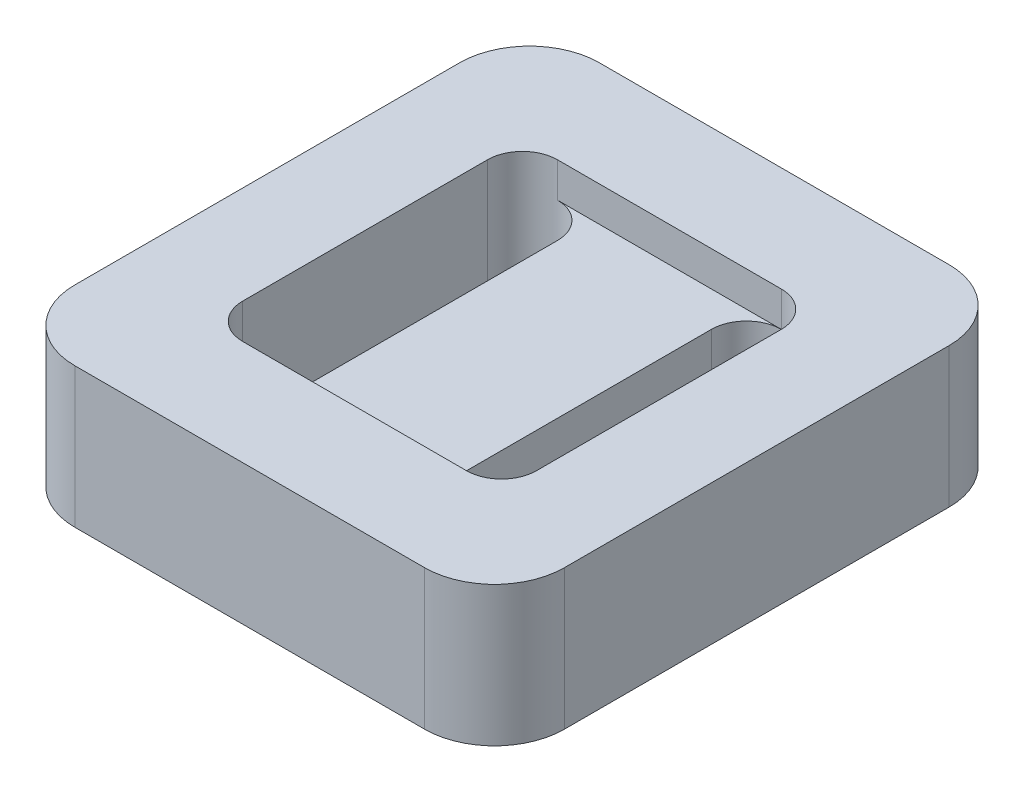
ISO-10303-21;
HEADER;
FILE_DESCRIPTION(('STEP AP214'),'2;1');
FILE_NAME('part.step','',(''),(''),'','','');
FILE_SCHEMA(('AUTOMOTIVE_DESIGN { 1 0 10303 214 1 1 1 1 }'));
ENDSEC;
DATA;
#1=APPLICATION_CONTEXT('core data for automotive mechanical design processes');
#2=APPLICATION_PROTOCOL_DEFINITION('international standard','automotive_design',2000,#1);
#3=PRODUCT_CONTEXT('',#1,'mechanical');
#4=PRODUCT('Part','Part','',(#3));
#5=PRODUCT_RELATED_PRODUCT_CATEGORY('part','',(#4));
#6=PRODUCT_DEFINITION_FORMATION('','',#4);
#7=PRODUCT_DEFINITION_CONTEXT('part definition',#1,'design');
#8=PRODUCT_DEFINITION('design','',#6,#7);
#9=PRODUCT_DEFINITION_SHAPE('','',#8);
#10=(LENGTH_UNIT() NAMED_UNIT(*) SI_UNIT(.MILLI.,.METRE.));
#11=(NAMED_UNIT(*) PLANE_ANGLE_UNIT() SI_UNIT($,.RADIAN.));
#12=(NAMED_UNIT(*) SI_UNIT($,.STERADIAN.) SOLID_ANGLE_UNIT());
#13=UNCERTAINTY_MEASURE_WITH_UNIT(LENGTH_MEASURE(1.E-05),#10,'distance_accuracy_value','');
#14=(GEOMETRIC_REPRESENTATION_CONTEXT(3) GLOBAL_UNCERTAINTY_ASSIGNED_CONTEXT((#13)) GLOBAL_UNIT_ASSIGNED_CONTEXT((#10,
#11,#12)) REPRESENTATION_CONTEXT('',''));
#15=CARTESIAN_POINT('',(0.,0.,0.));
#16=DIRECTION('',(0.,0.,1.));
#17=DIRECTION('',(1.,0.,0.));
#18=AXIS2_PLACEMENT_3D('',#15,#16,#17);
#19=CARTESIAN_POINT('',(-25.,20.,27.5));
#20=DIRECTION('',(0.,-1.,0.));
#21=DIRECTION('',(0.,0.,-1.));
#22=AXIS2_PLACEMENT_3D('',#19,#20,#21);
#23=PLANE('',#22);
#24=CARTESIAN_POINT('',(-25.,20.,27.5));
#25=DIRECTION('',(0.,1.,0.));
#26=DIRECTION('',(0.,0.,-1.));
#27=AXIS2_PLACEMENT_3D('',#24,#25,#26);
#28=CIRCLE('',#27,10.);
#29=CARTESIAN_POINT('',(-35.,20.,27.4999999999999));
#30=VERTEX_POINT('',#29);
#31=CARTESIAN_POINT('',(-24.9999999999999,20.,37.5));
#32=VERTEX_POINT('',#31);
#33=EDGE_CURVE('E258',#30,#32,#28,.T.);
#34=ORIENTED_EDGE('',*,*,#33,.T.);
#35=DIRECTION('',(1.,0.,0.));
#36=VECTOR('',#35,1.);
#37=CARTESIAN_POINT('',(-24.9999999999999,20.,37.5));
#38=LINE('',#37,#36);
#39=CARTESIAN_POINT('',(24.9999999999999,20.,37.5));
#40=VERTEX_POINT('',#39);
#41=EDGE_CURVE('E261',#32,#40,#38,.T.);
#42=ORIENTED_EDGE('',*,*,#41,.T.);
#43=CARTESIAN_POINT('',(25.,20.,27.5));
#44=DIRECTION('',(0.,1.,0.));
#45=DIRECTION('',(0.,0.,1.));
#46=AXIS2_PLACEMENT_3D('',#43,#44,#45);
#47=CIRCLE('',#46,10.);
#48=CARTESIAN_POINT('',(35.,20.,27.4999999999999));
#49=VERTEX_POINT('',#48);
#50=EDGE_CURVE('E264',#40,#49,#47,.T.);
#51=ORIENTED_EDGE('',*,*,#50,.T.);
#52=DIRECTION('',(0.,0.,-1.));
#53=VECTOR('',#52,1.);
#54=CARTESIAN_POINT('',(35.,20.,27.4999999999999));
#55=LINE('',#54,#53);
#56=CARTESIAN_POINT('',(35.,20.,-27.4999999999999));
#57=VERTEX_POINT('',#56);
#58=EDGE_CURVE('E266',#49,#57,#55,.T.);
#59=ORIENTED_EDGE('',*,*,#58,.T.);
#60=CARTESIAN_POINT('',(25.,20.,-27.5));
#61=DIRECTION('',(0.,1.,0.));
#62=DIRECTION('',(0.,0.,1.));
#63=AXIS2_PLACEMENT_3D('',#60,#61,#62);
#64=CIRCLE('',#63,10.);
#65=CARTESIAN_POINT('',(24.9999999999999,20.,-37.5));
#66=VERTEX_POINT('',#65);
#67=EDGE_CURVE('E268',#57,#66,#64,.T.);
#68=ORIENTED_EDGE('',*,*,#67,.T.);
#69=DIRECTION('',(-1.,0.,0.));
#70=VECTOR('',#69,1.);
#71=CARTESIAN_POINT('',(-24.9999999999999,20.,-37.5));
#72=LINE('',#71,#70);
#73=CARTESIAN_POINT('',(-24.9999999999999,20.,-37.5));
#74=VERTEX_POINT('',#73);
#75=EDGE_CURVE('E270',#66,#74,#72,.T.);
#76=ORIENTED_EDGE('',*,*,#75,.T.);
#77=CARTESIAN_POINT('',(-25.,20.,-27.5));
#78=DIRECTION('',(0.,1.,0.));
#79=DIRECTION('',(0.,0.,-1.));
#80=AXIS2_PLACEMENT_3D('',#77,#78,#79);
#81=CIRCLE('',#80,10.);
#82=CARTESIAN_POINT('',(-35.,20.,-27.4999999999999));
#83=VERTEX_POINT('',#82);
#84=EDGE_CURVE('E272',#74,#83,#81,.T.);
#85=ORIENTED_EDGE('',*,*,#84,.T.);
#86=DIRECTION('',(0.,0.,1.));
#87=VECTOR('',#86,1.);
#88=CARTESIAN_POINT('',(-35.,20.,27.4999999999999));
#89=LINE('',#88,#87);
#90=EDGE_CURVE('E274',#83,#30,#89,.T.);
#91=ORIENTED_EDGE('',*,*,#90,.T.);
#92=EDGE_LOOP('',(#34,#42,#51,#59,#68,#76,#85,#91));
#93=FACE_BOUND('',#92,.T.);
#94=DIRECTION('',(1.,0.,0.));
#95=VECTOR('',#94,1.);
#96=CARTESIAN_POINT('',(0.,20.,-22.5000000000001));
#97=LINE('',#96,#95);
#98=CARTESIAN_POINT('',(-16.,20.,-22.5));
#99=VERTEX_POINT('',#98);
#100=CARTESIAN_POINT('',(15.9999999999999,20.,-22.5000000000001));
#101=VERTEX_POINT('',#100);
#102=EDGE_CURVE('E189',#99,#101,#97,.T.);
#103=ORIENTED_EDGE('',*,*,#102,.T.);
#104=CARTESIAN_POINT('',(15.9999999999999,20.,-17.5000000000001));
#105=DIRECTION('',(0.,1.,0.));
#106=DIRECTION('',(0.,0.,-1.));
#107=AXIS2_PLACEMENT_3D('',#104,#105,#106);
#108=CIRCLE('',#107,5.);
#109=CARTESIAN_POINT('',(20.9999999999999,20.,-17.5000000000002));
#110=VERTEX_POINT('',#109);
#111=EDGE_CURVE('E208',#110,#101,#108,.T.);
#112=ORIENTED_EDGE('',*,*,#111,.F.);
#113=DIRECTION('',(0.,0.,-1.));
#114=VECTOR('',#113,1.);
#115=CARTESIAN_POINT('',(21.0000000000001,20.,17.4999999999999));
#116=LINE('',#115,#114);
#117=CARTESIAN_POINT('',(21.0000000000001,20.,17.4999999999999));
#118=VERTEX_POINT('',#117);
#119=EDGE_CURVE('E205',#118,#110,#116,.T.);
#120=ORIENTED_EDGE('',*,*,#119,.F.);
#121=CARTESIAN_POINT('',(16.0000000000001,20.,17.4999999999999));
#122=DIRECTION('',(0.,1.,0.));
#123=DIRECTION('',(0.,0.,-1.));
#124=AXIS2_PLACEMENT_3D('',#121,#122,#123);
#125=CIRCLE('',#124,5.);
#126=CARTESIAN_POINT('',(16.0000000000002,20.,22.4999999999999));
#127=VERTEX_POINT('',#126);
#128=EDGE_CURVE('E203',#127,#118,#125,.T.);
#129=ORIENTED_EDGE('',*,*,#128,.F.);
#130=DIRECTION('',(1.,0.,0.));
#131=VECTOR('',#130,1.);
#132=CARTESIAN_POINT('',(0.,20.,22.5));
#133=LINE('',#132,#131);
#134=CARTESIAN_POINT('',(-16.,20.,22.5));
#135=VERTEX_POINT('',#134);
#136=EDGE_CURVE('E406',#135,#127,#133,.T.);
#137=ORIENTED_EDGE('',*,*,#136,.F.);
#138=CARTESIAN_POINT('',(-16.,20.,17.5));
#139=DIRECTION('',(0.,1.,0.));
#140=DIRECTION('',(0.,0.,1.));
#141=AXIS2_PLACEMENT_3D('',#138,#139,#140);
#142=CIRCLE('',#141,5.);
#143=CARTESIAN_POINT('',(-21.,20.,17.5));
#144=VERTEX_POINT('',#143);
#145=EDGE_CURVE('E195',#144,#135,#142,.T.);
#146=ORIENTED_EDGE('',*,*,#145,.F.);
#147=DIRECTION('',(0.,0.,1.));
#148=VECTOR('',#147,1.);
#149=CARTESIAN_POINT('',(-21.,20.,17.5));
#150=LINE('',#149,#148);
#151=CARTESIAN_POINT('',(-21.,20.,-17.5));
#152=VERTEX_POINT('',#151);
#153=EDGE_CURVE('E236',#152,#144,#150,.T.);
#154=ORIENTED_EDGE('',*,*,#153,.F.);
#155=CARTESIAN_POINT('',(-16.,20.,-17.5));
#156=DIRECTION('',(0.,1.,0.));
#157=DIRECTION('',(0.,0.,1.));
#158=AXIS2_PLACEMENT_3D('',#155,#156,#157);
#159=CIRCLE('',#158,5.);
#160=EDGE_CURVE('E233',#99,#152,#159,.T.);
#161=ORIENTED_EDGE('',*,*,#160,.F.);
#162=EDGE_LOOP('',(#103,#112,#120,#129,#137,#146,#154,#161));
#163=FACE_BOUND('',#162,.T.);
#164=ADVANCED_FACE('F36',(#93,#163),#23,.F.);
#165=CARTESIAN_POINT('',(-16.,20.,17.5));
#166=DIRECTION('',(0.,-1.,0.));
#167=DIRECTION('',(0.,0.,-1.));
#168=AXIS2_PLACEMENT_3D('',#165,#166,#167);
#169=CYLINDRICAL_SURFACE('',#168,5.);
#170=ORIENTED_EDGE('',*,*,#145,.T.);
#171=DIRECTION('',(0.,1.,0.));
#172=VECTOR('',#171,1.);
#173=CARTESIAN_POINT('',(-16.,15.,22.5));
#174=LINE('',#173,#172);
#175=CARTESIAN_POINT('',(-16.,15.,22.5));
#176=VERTEX_POINT('',#175);
#177=EDGE_CURVE('E177',#176,#135,#174,.T.);
#178=ORIENTED_EDGE('',*,*,#177,.F.);
#179=CARTESIAN_POINT('',(-16.,15.,17.5));
#180=DIRECTION('',(0.,1.,0.));
#181=DIRECTION('',(0.,0.,1.));
#182=AXIS2_PLACEMENT_3D('',#179,#180,#181);
#183=CIRCLE('',#182,5.);
#184=CARTESIAN_POINT('',(-11.,15.,17.5));
#185=VERTEX_POINT('',#184);
#186=EDGE_CURVE('E181',#185,#176,#183,.F.);
#187=ORIENTED_EDGE('',*,*,#186,.F.);
#188=DIRECTION('',(0.,-1.,0.));
#189=VECTOR('',#188,1.);
#190=CARTESIAN_POINT('',(-11.,20.,17.5));
#191=LINE('',#190,#189);
#192=CARTESIAN_POINT('',(-11.,0.,17.5));
#193=VERTEX_POINT('',#192);
#194=EDGE_CURVE('E255',#185,#193,#191,.T.);
#195=ORIENTED_EDGE('',*,*,#194,.T.);
#196=CARTESIAN_POINT('',(-16.,0.,17.5));
#197=DIRECTION('',(0.,1.,0.));
#198=DIRECTION('',(0.,0.,1.));
#199=AXIS2_PLACEMENT_3D('',#196,#197,#198);
#200=CIRCLE('',#199,5.);
#201=CARTESIAN_POINT('',(-21.,0.,17.5));
#202=VERTEX_POINT('',#201);
#203=EDGE_CURVE('E231',#202,#193,#200,.T.);
#204=ORIENTED_EDGE('',*,*,#203,.F.);
#205=DIRECTION('',(0.,-1.,0.));
#206=VECTOR('',#205,1.);
#207=CARTESIAN_POINT('',(-21.,20.,17.5));
#208=LINE('',#207,#206);
#209=EDGE_CURVE('E238',#144,#202,#208,.T.);
#210=ORIENTED_EDGE('',*,*,#209,.F.);
#211=EDGE_LOOP('',(#170,#178,#187,#195,#204,#210));
#212=FACE_BOUND('',#211,.T.);
#213=ADVANCED_FACE('F192',(#212),#169,.F.);
#214=CARTESIAN_POINT('',(-11.,20.,17.5));
#215=DIRECTION('',(-1.,0.,0.));
#216=DIRECTION('',(0.,0.,1.));
#217=AXIS2_PLACEMENT_3D('',#214,#215,#216);
#218=PLANE('',#217);
#219=ORIENTED_EDGE('',*,*,#194,.F.);
#220=DIRECTION('',(0.,0.,1.));
#221=VECTOR('',#220,1.);
#222=CARTESIAN_POINT('',(-11.,15.,0.));
#223=LINE('',#222,#221);
#224=CARTESIAN_POINT('',(-11.,15.,-17.5));
#225=VERTEX_POINT('',#224);
#226=EDGE_CURVE('E186',#225,#185,#223,.T.);
#227=ORIENTED_EDGE('',*,*,#226,.F.);
#228=DIRECTION('',(0.,-1.,0.));
#229=VECTOR('',#228,1.);
#230=CARTESIAN_POINT('',(-11.,20.,-17.5));
#231=LINE('',#230,#229);
#232=CARTESIAN_POINT('',(-11.,0.,-17.5));
#233=VERTEX_POINT('',#232);
#234=EDGE_CURVE('E253',#225,#233,#231,.T.);
#235=ORIENTED_EDGE('',*,*,#234,.T.);
#236=DIRECTION('',(0.,0.,-1.));
#237=VECTOR('',#236,1.);
#238=CARTESIAN_POINT('',(-11.,0.,17.5));
#239=LINE('',#238,#237);
#240=EDGE_CURVE('E241',#193,#233,#239,.T.);
#241=ORIENTED_EDGE('',*,*,#240,.F.);
#242=EDGE_LOOP('',(#219,#227,#235,#241));
#243=FACE_BOUND('',#242,.T.);
#244=ADVANCED_FACE('F364',(#243),#218,.T.);
#245=CARTESIAN_POINT('',(15.9999999999999,20.,-17.5000000000001));
#246=DIRECTION('',(0.,-1.,0.));
#247=DIRECTION('',(0.,0.,-1.));
#248=AXIS2_PLACEMENT_3D('',#245,#246,#247);
#249=CYLINDRICAL_SURFACE('',#248,5.);
#250=ORIENTED_EDGE('',*,*,#111,.T.);
#251=DIRECTION('',(0.,1.,0.));
#252=VECTOR('',#251,1.);
#253=CARTESIAN_POINT('',(15.9999999999999,15.,-22.5000000000001));
#254=LINE('',#253,#252);
#255=CARTESIAN_POINT('',(15.9999999999999,15.,-22.5000000000001));
#256=VERTEX_POINT('',#255);
#257=EDGE_CURVE('E197',#256,#101,#254,.T.);
#258=ORIENTED_EDGE('',*,*,#257,.F.);
#259=CARTESIAN_POINT('',(15.9999999999999,15.,-17.5000000000001));
#260=DIRECTION('',(0.,1.,0.));
#261=DIRECTION('',(0.,0.,1.));
#262=AXIS2_PLACEMENT_3D('',#259,#260,#261);
#263=CIRCLE('',#262,5.);
#264=CARTESIAN_POINT('',(10.9999999999999,15.,-17.5000000000001));
#265=VERTEX_POINT('',#264);
#266=EDGE_CURVE('E428',#265,#256,#263,.F.);
#267=ORIENTED_EDGE('',*,*,#266,.F.);
#268=DIRECTION('',(0.,-1.,0.));
#269=VECTOR('',#268,1.);
#270=CARTESIAN_POINT('',(10.9999999999999,20.,-17.5000000000001));
#271=LINE('',#270,#269);
#272=CARTESIAN_POINT('',(10.9999999999999,0.,-17.5000000000001));
#273=VERTEX_POINT('',#272);
#274=EDGE_CURVE('E224',#265,#273,#271,.T.);
#275=ORIENTED_EDGE('',*,*,#274,.T.);
#276=CARTESIAN_POINT('',(15.9999999999999,0.,-17.5000000000001));
#277=DIRECTION('',(0.,1.,0.));
#278=DIRECTION('',(0.,0.,-1.));
#279=AXIS2_PLACEMENT_3D('',#276,#277,#278);
#280=CIRCLE('',#279,5.);
#281=CARTESIAN_POINT('',(20.9999999999999,0.,-17.5000000000002));
#282=VERTEX_POINT('',#281);
#283=EDGE_CURVE('E218',#282,#273,#280,.T.);
#284=ORIENTED_EDGE('',*,*,#283,.F.);
#285=DIRECTION('',(0.,-1.,0.));
#286=VECTOR('',#285,1.);
#287=CARTESIAN_POINT('',(20.9999999999999,20.,-17.5000000000002));
#288=LINE('',#287,#286);
#289=EDGE_CURVE('E226',#110,#282,#288,.T.);
#290=ORIENTED_EDGE('',*,*,#289,.F.);
#291=EDGE_LOOP('',(#250,#258,#267,#275,#284,#290));
#292=FACE_BOUND('',#291,.T.);
#293=ADVANCED_FACE('F388',(#292),#249,.F.);
#294=CARTESIAN_POINT('',(11.0000000000001,20.,17.4999999999999));
#295=DIRECTION('',(1.,0.,0.));
#296=DIRECTION('',(0.,0.,-1.));
#297=AXIS2_PLACEMENT_3D('',#294,#295,#296);
#298=PLANE('',#297);
#299=ORIENTED_EDGE('',*,*,#274,.F.);
#300=DIRECTION('',(0.,0.,-1.));
#301=VECTOR('',#300,1.);
#302=CARTESIAN_POINT('',(11.,15.,0.));
#303=LINE('',#302,#301);
#304=CARTESIAN_POINT('',(11.0000000000001,15.,17.4999999999999));
#305=VERTEX_POINT('',#304);
#306=EDGE_CURVE('E427',#305,#265,#303,.T.);
#307=ORIENTED_EDGE('',*,*,#306,.F.);
#308=DIRECTION('',(0.,-1.,0.));
#309=VECTOR('',#308,1.);
#310=CARTESIAN_POINT('',(11.0000000000001,20.,17.4999999999999));
#311=LINE('',#310,#309);
#312=CARTESIAN_POINT('',(11.0000000000001,0.,17.4999999999999));
#313=VERTEX_POINT('',#312);
#314=EDGE_CURVE('E58',#305,#313,#311,.T.);
#315=ORIENTED_EDGE('',*,*,#314,.T.);
#316=DIRECTION('',(0.,0.,1.));
#317=VECTOR('',#316,1.);
#318=CARTESIAN_POINT('',(11.0000000000001,0.,17.4999999999999));
#319=LINE('',#318,#317);
#320=EDGE_CURVE('E206',#273,#313,#319,.T.);
#321=ORIENTED_EDGE('',*,*,#320,.F.);
#322=EDGE_LOOP('',(#299,#307,#315,#321));
#323=FACE_BOUND('',#322,.T.);
#324=ADVANCED_FACE('F370',(#323),#298,.T.);
#325=CARTESIAN_POINT('',(-25.,0.,27.5));
#326=DIRECTION('',(0.,-1.,0.));
#327=DIRECTION('',(0.,0.,-1.));
#328=AXIS2_PLACEMENT_3D('',#325,#326,#327);
#329=PLANE('',#328);
#330=CARTESIAN_POINT('',(-25.,0.,27.5));
#331=DIRECTION('',(0.,1.,0.));
#332=DIRECTION('',(0.,0.,-1.));
#333=AXIS2_PLACEMENT_3D('',#330,#331,#332);
#334=CIRCLE('',#333,10.);
#335=CARTESIAN_POINT('',(-35.,0.,27.4999999999999));
#336=VERTEX_POINT('',#335);
#337=CARTESIAN_POINT('',(-24.9999999999999,0.,37.5));
#338=VERTEX_POINT('',#337);
#339=EDGE_CURVE('E257',#336,#338,#334,.T.);
#340=ORIENTED_EDGE('',*,*,#339,.F.);
#341=DIRECTION('',(0.,0.,1.));
#342=VECTOR('',#341,1.);
#343=CARTESIAN_POINT('',(-35.,0.,27.4999999999999));
#344=LINE('',#343,#342);
#345=CARTESIAN_POINT('',(-35.,0.,-27.4999999999999));
#346=VERTEX_POINT('',#345);
#347=EDGE_CURVE('E262',#346,#336,#344,.T.);
#348=ORIENTED_EDGE('',*,*,#347,.F.);
#349=CARTESIAN_POINT('',(-25.,0.,-27.5));
#350=DIRECTION('',(0.,1.,0.));
#351=DIRECTION('',(0.,0.,-1.));
#352=AXIS2_PLACEMENT_3D('',#349,#350,#351);
#353=CIRCLE('',#352,10.);
#354=CARTESIAN_POINT('',(-24.9999999999999,0.,-37.5));
#355=VERTEX_POINT('',#354);
#356=EDGE_CURVE('E289',#355,#346,#353,.T.);
#357=ORIENTED_EDGE('',*,*,#356,.F.);
#358=DIRECTION('',(-1.,0.,0.));
#359=VECTOR('',#358,1.);
#360=CARTESIAN_POINT('',(-24.9999999999999,0.,-37.5));
#361=LINE('',#360,#359);
#362=CARTESIAN_POINT('',(24.9999999999999,0.,-37.5));
#363=VERTEX_POINT('',#362);
#364=EDGE_CURVE('E287',#363,#355,#361,.T.);
#365=ORIENTED_EDGE('',*,*,#364,.F.);
#366=CARTESIAN_POINT('',(25.,0.,-27.5));
#367=DIRECTION('',(0.,1.,0.));
#368=DIRECTION('',(0.,0.,1.));
#369=AXIS2_PLACEMENT_3D('',#366,#367,#368);
#370=CIRCLE('',#369,10.);
#371=CARTESIAN_POINT('',(35.,0.,-27.4999999999999));
#372=VERTEX_POINT('',#371);
#373=EDGE_CURVE('E285',#372,#363,#370,.T.);
#374=ORIENTED_EDGE('',*,*,#373,.F.);
#375=DIRECTION('',(0.,0.,-1.));
#376=VECTOR('',#375,1.);
#377=CARTESIAN_POINT('',(35.,0.,27.4999999999999));
#378=LINE('',#377,#376);
#379=CARTESIAN_POINT('',(35.,0.,27.4999999999999));
#380=VERTEX_POINT('',#379);
#381=EDGE_CURVE('E283',#380,#372,#378,.T.);
#382=ORIENTED_EDGE('',*,*,#381,.F.);
#383=CARTESIAN_POINT('',(25.,0.,27.5));
#384=DIRECTION('',(0.,1.,0.));
#385=DIRECTION('',(0.,0.,1.));
#386=AXIS2_PLACEMENT_3D('',#383,#384,#385);
#387=CIRCLE('',#386,10.);
#388=CARTESIAN_POINT('',(24.9999999999999,0.,37.5));
#389=VERTEX_POINT('',#388);
#390=EDGE_CURVE('E281',#389,#380,#387,.T.);
#391=ORIENTED_EDGE('',*,*,#390,.F.);
#392=DIRECTION('',(1.,0.,0.));
#393=VECTOR('',#392,1.);
#394=CARTESIAN_POINT('',(-24.9999999999999,0.,37.5));
#395=LINE('',#394,#393);
#396=EDGE_CURVE('E279',#338,#389,#395,.T.);
#397=ORIENTED_EDGE('',*,*,#396,.F.);
#398=EDGE_LOOP('',(#340,#348,#357,#365,#374,#382,#391,#397));
#399=FACE_BOUND('',#398,.T.);
#400=DIRECTION('',(0.,0.,1.));
#401=VECTOR('',#400,1.);
#402=CARTESIAN_POINT('',(-21.,0.,17.5));
#403=LINE('',#402,#401);
#404=CARTESIAN_POINT('',(-21.,0.,-17.5));
#405=VERTEX_POINT('',#404);
#406=EDGE_CURVE('E234',#405,#202,#403,.T.);
#407=ORIENTED_EDGE('',*,*,#406,.T.);
#408=ORIENTED_EDGE('',*,*,#203,.T.);
#409=ORIENTED_EDGE('',*,*,#240,.T.);
#410=CARTESIAN_POINT('',(-16.,0.,-17.5));
#411=DIRECTION('',(0.,1.,0.));
#412=DIRECTION('',(0.,0.,1.));
#413=AXIS2_PLACEMENT_3D('',#410,#411,#412);
#414=CIRCLE('',#413,5.);
#415=EDGE_CURVE('E244',#233,#405,#414,.T.);
#416=ORIENTED_EDGE('',*,*,#415,.T.);
#417=EDGE_LOOP('',(#407,#408,#409,#416));
#418=FACE_BOUND('',#417,.T.);
#419=ORIENTED_EDGE('',*,*,#320,.T.);
#420=CARTESIAN_POINT('',(16.0000000000001,0.,17.4999999999999));
#421=DIRECTION('',(0.,1.,0.));
#422=DIRECTION('',(0.,0.,-1.));
#423=AXIS2_PLACEMENT_3D('',#420,#421,#422);
#424=CIRCLE('',#423,5.);
#425=CARTESIAN_POINT('',(21.0000000000001,0.,17.4999999999999));
#426=VERTEX_POINT('',#425);
#427=EDGE_CURVE('E211',#313,#426,#424,.T.);
#428=ORIENTED_EDGE('',*,*,#427,.T.);
#429=DIRECTION('',(0.,0.,-1.));
#430=VECTOR('',#429,1.);
#431=CARTESIAN_POINT('',(21.0000000000001,0.,17.4999999999999));
#432=LINE('',#431,#430);
#433=EDGE_CURVE('E214',#426,#282,#432,.T.);
#434=ORIENTED_EDGE('',*,*,#433,.T.);
#435=ORIENTED_EDGE('',*,*,#283,.T.);
#436=EDGE_LOOP('',(#419,#428,#434,#435));
#437=FACE_BOUND('',#436,.T.);
#438=ADVANCED_FACE('F319',(#399,#418,#437),#329,.T.);
#439=CARTESIAN_POINT('',(-25.,20.,27.5));
#440=DIRECTION('',(0.,-1.,0.));
#441=DIRECTION('',(0.,0.,-1.));
#442=AXIS2_PLACEMENT_3D('',#439,#440,#441);
#443=CYLINDRICAL_SURFACE('',#442,10.);
#444=ORIENTED_EDGE('',*,*,#339,.T.);
#445=DIRECTION('',(0.,-1.,0.));
#446=VECTOR('',#445,1.);
#447=CARTESIAN_POINT('',(-24.9999999999999,20.,37.5));
#448=LINE('',#447,#446);
#449=EDGE_CURVE('E11',#32,#338,#448,.T.);
#450=ORIENTED_EDGE('',*,*,#449,.F.);
#451=ORIENTED_EDGE('',*,*,#33,.F.);
#452=DIRECTION('',(0.,-1.,0.));
#453=VECTOR('',#452,1.);
#454=CARTESIAN_POINT('',(-35.,20.,27.4999999999999));
#455=LINE('',#454,#453);
#456=EDGE_CURVE('E276',#30,#336,#455,.T.);
#457=ORIENTED_EDGE('',*,*,#456,.T.);
#458=EDGE_LOOP('',(#444,#450,#451,#457));
#459=FACE_BOUND('',#458,.T.);
#460=ADVANCED_FACE('F38',(#459),#443,.T.);
#461=CARTESIAN_POINT('',(-24.9999999999999,20.,37.5));
#462=DIRECTION('',(0.,0.,-1.));
#463=DIRECTION('',(-1.,0.,0.));
#464=AXIS2_PLACEMENT_3D('',#461,#462,#463);
#465=PLANE('',#464);
#466=ORIENTED_EDGE('',*,*,#396,.T.);
#467=DIRECTION('',(0.,-1.,0.));
#468=VECTOR('',#467,1.);
#469=CARTESIAN_POINT('',(24.9999999999999,20.,37.5));
#470=LINE('',#469,#468);
#471=EDGE_CURVE('E44',#40,#389,#470,.T.);
#472=ORIENTED_EDGE('',*,*,#471,.F.);
#473=ORIENTED_EDGE('',*,*,#41,.F.);
#474=ORIENTED_EDGE('',*,*,#449,.T.);
#475=EDGE_LOOP('',(#466,#472,#473,#474));
#476=FACE_BOUND('',#475,.T.);
#477=ADVANCED_FACE('F337',(#476),#465,.F.);
#478=CARTESIAN_POINT('',(25.,20.,27.5));
#479=DIRECTION('',(0.,-1.,0.));
#480=DIRECTION('',(0.,0.,-1.));
#481=AXIS2_PLACEMENT_3D('',#478,#479,#480);
#482=CYLINDRICAL_SURFACE('',#481,10.);
#483=ORIENTED_EDGE('',*,*,#390,.T.);
#484=DIRECTION('',(0.,-1.,0.));
#485=VECTOR('',#484,1.);
#486=CARTESIAN_POINT('',(35.,20.,27.4999999999999));
#487=LINE('',#486,#485);
#488=EDGE_CURVE('E306',#49,#380,#487,.T.);
#489=ORIENTED_EDGE('',*,*,#488,.F.);
#490=ORIENTED_EDGE('',*,*,#50,.F.);
#491=ORIENTED_EDGE('',*,*,#471,.T.);
#492=EDGE_LOOP('',(#483,#489,#490,#491));
#493=FACE_BOUND('',#492,.T.);
#494=ADVANCED_FACE('F313',(#493),#482,.T.);
#495=CARTESIAN_POINT('',(35.,20.,27.4999999999999));
#496=DIRECTION('',(-1.,0.,0.));
#497=DIRECTION('',(0.,0.,1.));
#498=AXIS2_PLACEMENT_3D('',#495,#496,#497);
#499=PLANE('',#498);
#500=ORIENTED_EDGE('',*,*,#381,.T.);
#501=DIRECTION('',(0.,-1.,0.));
#502=VECTOR('',#501,1.);
#503=CARTESIAN_POINT('',(35.,20.,-27.4999999999999));
#504=LINE('',#503,#502);
#505=EDGE_CURVE('E303',#57,#372,#504,.T.);
#506=ORIENTED_EDGE('',*,*,#505,.F.);
#507=ORIENTED_EDGE('',*,*,#58,.F.);
#508=ORIENTED_EDGE('',*,*,#488,.T.);
#509=EDGE_LOOP('',(#500,#506,#507,#508));
#510=FACE_BOUND('',#509,.T.);
#511=ADVANCED_FACE('F325',(#510),#499,.F.);
#512=CARTESIAN_POINT('',(25.,20.,-27.5));
#513=DIRECTION('',(0.,-1.,0.));
#514=DIRECTION('',(0.,0.,-1.));
#515=AXIS2_PLACEMENT_3D('',#512,#513,#514);
#516=CYLINDRICAL_SURFACE('',#515,10.);
#517=ORIENTED_EDGE('',*,*,#373,.T.);
#518=DIRECTION('',(0.,-1.,0.));
#519=VECTOR('',#518,1.);
#520=CARTESIAN_POINT('',(24.9999999999999,20.,-37.5));
#521=LINE('',#520,#519);
#522=EDGE_CURVE('E300',#66,#363,#521,.T.);
#523=ORIENTED_EDGE('',*,*,#522,.F.);
#524=ORIENTED_EDGE('',*,*,#67,.F.);
#525=ORIENTED_EDGE('',*,*,#505,.T.);
#526=EDGE_LOOP('',(#517,#523,#524,#525));
#527=FACE_BOUND('',#526,.T.);
#528=ADVANCED_FACE('F329',(#527),#516,.T.);
#529=CARTESIAN_POINT('',(-24.9999999999999,20.,-37.5));
#530=DIRECTION('',(0.,0.,1.));
#531=DIRECTION('',(1.,0.,0.));
#532=AXIS2_PLACEMENT_3D('',#529,#530,#531);
#533=PLANE('',#532);
#534=ORIENTED_EDGE('',*,*,#364,.T.);
#535=DIRECTION('',(0.,-1.,0.));
#536=VECTOR('',#535,1.);
#537=CARTESIAN_POINT('',(-24.9999999999999,20.,-37.5));
#538=LINE('',#537,#536);
#539=EDGE_CURVE('E297',#74,#355,#538,.T.);
#540=ORIENTED_EDGE('',*,*,#539,.F.);
#541=ORIENTED_EDGE('',*,*,#75,.F.);
#542=ORIENTED_EDGE('',*,*,#522,.T.);
#543=EDGE_LOOP('',(#534,#540,#541,#542));
#544=FACE_BOUND('',#543,.T.);
#545=ADVANCED_FACE('F350',(#544),#533,.F.);
#546=CARTESIAN_POINT('',(-25.,20.,-27.5));
#547=DIRECTION('',(0.,-1.,0.));
#548=DIRECTION('',(0.,0.,-1.));
#549=AXIS2_PLACEMENT_3D('',#546,#547,#548);
#550=CYLINDRICAL_SURFACE('',#549,10.);
#551=ORIENTED_EDGE('',*,*,#356,.T.);
#552=DIRECTION('',(0.,-1.,0.));
#553=VECTOR('',#552,1.);
#554=CARTESIAN_POINT('',(-35.,20.,-27.4999999999999));
#555=LINE('',#554,#553);
#556=EDGE_CURVE('E294',#83,#346,#555,.T.);
#557=ORIENTED_EDGE('',*,*,#556,.F.);
#558=ORIENTED_EDGE('',*,*,#84,.F.);
#559=ORIENTED_EDGE('',*,*,#539,.T.);
#560=EDGE_LOOP('',(#551,#557,#558,#559));
#561=FACE_BOUND('',#560,.T.);
#562=ADVANCED_FACE('F348',(#561),#550,.T.);
#563=CARTESIAN_POINT('',(-35.,20.,27.4999999999999));
#564=DIRECTION('',(1.,0.,0.));
#565=DIRECTION('',(0.,0.,-1.));
#566=AXIS2_PLACEMENT_3D('',#563,#564,#565);
#567=PLANE('',#566);
#568=ORIENTED_EDGE('',*,*,#347,.T.);
#569=ORIENTED_EDGE('',*,*,#456,.F.);
#570=ORIENTED_EDGE('',*,*,#90,.F.);
#571=ORIENTED_EDGE('',*,*,#556,.T.);
#572=EDGE_LOOP('',(#568,#569,#570,#571));
#573=FACE_BOUND('',#572,.T.);
#574=ADVANCED_FACE('F343',(#573),#567,.F.);
#575=CARTESIAN_POINT('',(-16.,20.,-17.5));
#576=DIRECTION('',(0.,-1.,0.));
#577=DIRECTION('',(0.,0.,-1.));
#578=AXIS2_PLACEMENT_3D('',#575,#576,#577);
#579=CYLINDRICAL_SURFACE('',#578,5.);
#580=DIRECTION('',(0.,1.,0.));
#581=VECTOR('',#580,1.);
#582=CARTESIAN_POINT('',(-16.,15.,-22.5));
#583=LINE('',#582,#581);
#584=CARTESIAN_POINT('',(-16.,15.,-22.5));
#585=VERTEX_POINT('',#584);
#586=EDGE_CURVE('E215',#585,#99,#583,.T.);
#587=ORIENTED_EDGE('',*,*,#586,.T.);
#588=ORIENTED_EDGE('',*,*,#160,.T.);
#589=DIRECTION('',(0.,-1.,0.));
#590=VECTOR('',#589,1.);
#591=CARTESIAN_POINT('',(-21.,20.,-17.5));
#592=LINE('',#591,#590);
#593=EDGE_CURVE('E251',#152,#405,#592,.T.);
#594=ORIENTED_EDGE('',*,*,#593,.T.);
#595=ORIENTED_EDGE('',*,*,#415,.F.);
#596=ORIENTED_EDGE('',*,*,#234,.F.);
#597=CARTESIAN_POINT('',(-16.,15.,-17.5));
#598=DIRECTION('',(0.,1.,0.));
#599=DIRECTION('',(0.,0.,1.));
#600=AXIS2_PLACEMENT_3D('',#597,#598,#599);
#601=CIRCLE('',#600,5.);
#602=EDGE_CURVE('E199',#585,#225,#601,.F.);
#603=ORIENTED_EDGE('',*,*,#602,.F.);
#604=EDGE_LOOP('',(#587,#588,#594,#595,#596,#603));
#605=FACE_BOUND('',#604,.T.);
#606=ADVANCED_FACE('F372',(#605),#579,.F.);
#607=CARTESIAN_POINT('',(-21.,20.,17.5));
#608=DIRECTION('',(1.,0.,0.));
#609=DIRECTION('',(0.,0.,-1.));
#610=AXIS2_PLACEMENT_3D('',#607,#608,#609);
#611=PLANE('',#610);
#612=ORIENTED_EDGE('',*,*,#406,.F.);
#613=ORIENTED_EDGE('',*,*,#593,.F.);
#614=ORIENTED_EDGE('',*,*,#153,.T.);
#615=ORIENTED_EDGE('',*,*,#209,.T.);
#616=EDGE_LOOP('',(#612,#613,#614,#615));
#617=FACE_BOUND('',#616,.T.);
#618=ADVANCED_FACE('F376',(#617),#611,.T.);
#619=CARTESIAN_POINT('',(16.0000000000001,20.,17.4999999999999));
#620=DIRECTION('',(0.,-1.,0.));
#621=DIRECTION('',(0.,0.,-1.));
#622=AXIS2_PLACEMENT_3D('',#619,#620,#621);
#623=CYLINDRICAL_SURFACE('',#622,5.);
#624=DIRECTION('',(0.,1.,0.));
#625=VECTOR('',#624,1.);
#626=CARTESIAN_POINT('',(16.0000000000002,15.,22.4999999999999));
#627=LINE('',#626,#625);
#628=CARTESIAN_POINT('',(16.0000000000002,15.,22.4999999999999));
#629=VERTEX_POINT('',#628);
#630=EDGE_CURVE('E180',#629,#127,#627,.T.);
#631=ORIENTED_EDGE('',*,*,#630,.T.);
#632=ORIENTED_EDGE('',*,*,#128,.T.);
#633=DIRECTION('',(0.,-1.,0.));
#634=VECTOR('',#633,1.);
#635=CARTESIAN_POINT('',(21.0000000000001,20.,17.4999999999999));
#636=LINE('',#635,#634);
#637=EDGE_CURVE('E228',#118,#426,#636,.T.);
#638=ORIENTED_EDGE('',*,*,#637,.T.);
#639=ORIENTED_EDGE('',*,*,#427,.F.);
#640=ORIENTED_EDGE('',*,*,#314,.F.);
#641=CARTESIAN_POINT('',(16.0000000000001,15.,17.4999999999999));
#642=DIRECTION('',(0.,1.,0.));
#643=DIRECTION('',(0.,0.,1.));
#644=AXIS2_PLACEMENT_3D('',#641,#642,#643);
#645=CIRCLE('',#644,5.);
#646=EDGE_CURVE('E51',#629,#305,#645,.F.);
#647=ORIENTED_EDGE('',*,*,#646,.F.);
#648=EDGE_LOOP('',(#631,#632,#638,#639,#640,#647));
#649=FACE_BOUND('',#648,.T.);
#650=ADVANCED_FACE('F382',(#649),#623,.F.);
#651=CARTESIAN_POINT('',(21.0000000000001,20.,17.4999999999999));
#652=DIRECTION('',(-1.,0.,0.));
#653=DIRECTION('',(0.,0.,1.));
#654=AXIS2_PLACEMENT_3D('',#651,#652,#653);
#655=PLANE('',#654);
#656=ORIENTED_EDGE('',*,*,#433,.F.);
#657=ORIENTED_EDGE('',*,*,#637,.F.);
#658=ORIENTED_EDGE('',*,*,#119,.T.);
#659=ORIENTED_EDGE('',*,*,#289,.T.);
#660=EDGE_LOOP('',(#656,#657,#658,#659));
#661=FACE_BOUND('',#660,.T.);
#662=ADVANCED_FACE('F423',(#661),#655,.T.);
#663=CARTESIAN_POINT('',(0.,15.,-22.5000000000001));
#664=DIRECTION('',(0.,0.,1.));
#665=DIRECTION('',(1.,0.,0.));
#666=AXIS2_PLACEMENT_3D('',#663,#664,#665);
#667=PLANE('',#666);
#668=ORIENTED_EDGE('',*,*,#102,.F.);
#669=ORIENTED_EDGE('',*,*,#586,.F.);
#670=DIRECTION('',(1.,0.,0.));
#671=VECTOR('',#670,1.);
#672=CARTESIAN_POINT('',(0.,15.,-22.5000000000001));
#673=LINE('',#672,#671);
#674=EDGE_CURVE('E416',#585,#256,#673,.T.);
#675=ORIENTED_EDGE('',*,*,#674,.T.);
#676=ORIENTED_EDGE('',*,*,#257,.T.);
#677=EDGE_LOOP('',(#668,#669,#675,#676));
#678=FACE_BOUND('',#677,.T.);
#679=ADVANCED_FACE('F414',(#678),#667,.T.);
#680=CARTESIAN_POINT('',(0.,15.,22.5));
#681=DIRECTION('',(0.,0.,1.));
#682=DIRECTION('',(1.,0.,0.));
#683=AXIS2_PLACEMENT_3D('',#680,#681,#682);
#684=PLANE('',#683);
#685=ORIENTED_EDGE('',*,*,#136,.T.);
#686=ORIENTED_EDGE('',*,*,#630,.F.);
#687=DIRECTION('',(1.,0.,0.));
#688=VECTOR('',#687,1.);
#689=CARTESIAN_POINT('',(0.,15.,22.5));
#690=LINE('',#689,#688);
#691=EDGE_CURVE('E173',#176,#629,#690,.T.);
#692=ORIENTED_EDGE('',*,*,#691,.F.);
#693=ORIENTED_EDGE('',*,*,#177,.T.);
#694=EDGE_LOOP('',(#685,#686,#692,#693));
#695=FACE_BOUND('',#694,.T.);
#696=ADVANCED_FACE('F175',(#695),#684,.F.);
#697=CARTESIAN_POINT('',(0.,15.,0.));
#698=DIRECTION('',(0.,1.,0.));
#699=DIRECTION('',(0.,0.,1.));
#700=AXIS2_PLACEMENT_3D('',#697,#698,#699);
#701=PLANE('',#700);
#702=ORIENTED_EDGE('',*,*,#186,.T.);
#703=ORIENTED_EDGE('',*,*,#691,.T.);
#704=ORIENTED_EDGE('',*,*,#646,.T.);
#705=ORIENTED_EDGE('',*,*,#306,.T.);
#706=ORIENTED_EDGE('',*,*,#266,.T.);
#707=ORIENTED_EDGE('',*,*,#674,.F.);
#708=ORIENTED_EDGE('',*,*,#602,.T.);
#709=ORIENTED_EDGE('',*,*,#226,.T.);
#710=EDGE_LOOP('',(#702,#703,#704,#705,#706,#707,#708,#709));
#711=FACE_BOUND('',#710,.T.);
#712=ADVANCED_FACE('F184',(#711),#701,.T.);
#713=CLOSED_SHELL('',(#164,#213,#244,#293,#324,#438,#460,#477,#494,#511,#528,#545,#562,#574,
#606,#618,#650,#662,#679,#696,#712));
#714=MANIFOLD_SOLID_BREP('B2',#713);
#715=ADVANCED_BREP_SHAPE_REPRESENTATION('',(#18,#714),#14);
#716=SHAPE_DEFINITION_REPRESENTATION(#9,#715);
ENDSEC;
END-ISO-10303-21;
